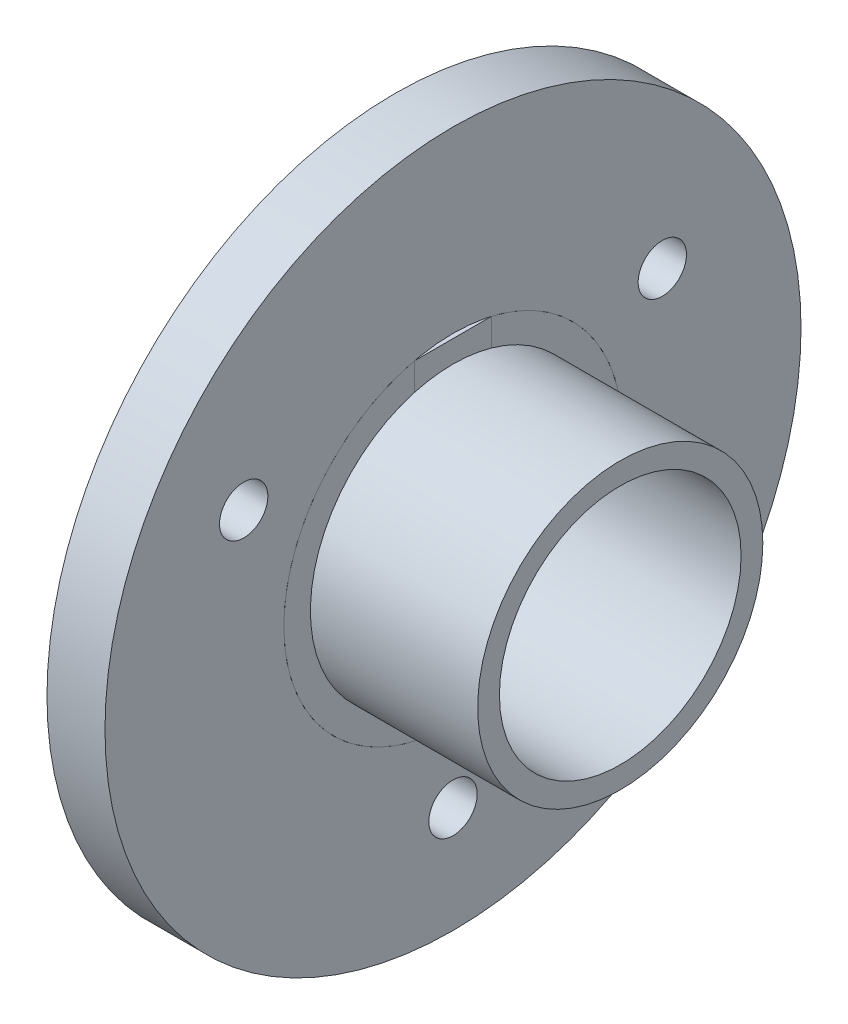
ISO-10303-21;
HEADER;
FILE_DESCRIPTION(('STEP AP214'),'2;1');
FILE_NAME('part.step','',(''),(''),'','','');
FILE_SCHEMA(('AUTOMOTIVE_DESIGN { 1 0 10303 214 1 1 1 1 }'));
ENDSEC;
DATA;
#1=APPLICATION_CONTEXT('core data for automotive mechanical design processes');
#2=APPLICATION_PROTOCOL_DEFINITION('international standard','automotive_design',2000,#1);
#3=PRODUCT_CONTEXT('',#1,'mechanical');
#4=PRODUCT('Part','Part','',(#3));
#5=PRODUCT_RELATED_PRODUCT_CATEGORY('part','',(#4));
#6=PRODUCT_DEFINITION_FORMATION('','',#4);
#7=PRODUCT_DEFINITION_CONTEXT('part definition',#1,'design');
#8=PRODUCT_DEFINITION('design','',#6,#7);
#9=PRODUCT_DEFINITION_SHAPE('','',#8);
#10=(LENGTH_UNIT() NAMED_UNIT(*) SI_UNIT(.MILLI.,.METRE.));
#11=(NAMED_UNIT(*) PLANE_ANGLE_UNIT() SI_UNIT($,.RADIAN.));
#12=(NAMED_UNIT(*) SI_UNIT($,.STERADIAN.) SOLID_ANGLE_UNIT());
#13=UNCERTAINTY_MEASURE_WITH_UNIT(LENGTH_MEASURE(1.E-05),#10,'distance_accuracy_value','');
#14=(GEOMETRIC_REPRESENTATION_CONTEXT(3) GLOBAL_UNCERTAINTY_ASSIGNED_CONTEXT((#13)) GLOBAL_UNIT_ASSIGNED_CONTEXT((#10,
#11,#12)) REPRESENTATION_CONTEXT('',''));
#15=CARTESIAN_POINT('',(0.,0.,0.));
#16=DIRECTION('',(0.,0.,1.));
#17=DIRECTION('',(1.,0.,0.));
#18=AXIS2_PLACEMENT_3D('',#15,#16,#17);
#19=CARTESIAN_POINT('',(-121.650612222677,-138.770848591098,4.));
#20=DIRECTION('',(0.,0.,1.));
#21=DIRECTION('',(0.,-1.,0.));
#22=AXIS2_PLACEMENT_3D('',#19,#20,#21);
#23=PLANE('',#22);
#24=DIRECTION('',(0.,-1.,0.));
#25=VECTOR('',#24,1.);
#26=CARTESIAN_POINT('',(-133.35,-138.770848591098,4.));
#27=LINE('',#26,#25);
#28=CARTESIAN_POINT('',(-133.35,-138.770848591098,4.));
#29=VERTEX_POINT('',#28);
#30=CARTESIAN_POINT('',(-133.35,-147.307573628499,4.));
#31=VERTEX_POINT('',#30);
#32=EDGE_CURVE('E58',#29,#31,#27,.T.);
#33=ORIENTED_EDGE('',*,*,#32,.F.);
#34=DIRECTION('',(-1.,0.,0.));
#35=VECTOR('',#34,1.);
#36=CARTESIAN_POINT('',(-121.650612222677,-138.770848591098,4.));
#37=LINE('',#36,#35);
#38=CARTESIAN_POINT('',(-149.35,-138.770848591098,4.));
#39=VERTEX_POINT('',#38);
#40=EDGE_CURVE('E86',#29,#39,#37,.T.);
#41=ORIENTED_EDGE('',*,*,#40,.T.);
#42=DIRECTION('',(0.,1.,0.));
#43=VECTOR('',#42,1.);
#44=CARTESIAN_POINT('',(-149.35,-138.770848591098,4.));
#45=LINE('',#44,#43);
#46=CARTESIAN_POINT('',(-149.35,-147.307573628499,4.));
#47=VERTEX_POINT('',#46);
#48=EDGE_CURVE('E90',#47,#39,#45,.T.);
#49=ORIENTED_EDGE('',*,*,#48,.F.);
#50=DIRECTION('',(-1.,0.,0.));
#51=VECTOR('',#50,1.);
#52=CARTESIAN_POINT('',(-121.650612222677,-147.307573628499,4.));
#53=LINE('',#52,#51);
#54=EDGE_CURVE('E113',#31,#47,#53,.T.);
#55=ORIENTED_EDGE('',*,*,#54,.F.);
#56=EDGE_LOOP('',(#33,#41,#49,#55));
#57=FACE_BOUND('',#56,.T.);
#58=ADVANCED_FACE('F50',(#57),#23,.T.);
#59=CARTESIAN_POINT('',(-121.650612222677,-147.307573628499,4.));
#60=DIRECTION('',(0.,-1.,0.));
#61=DIRECTION('',(0.,0.,-1.));
#62=AXIS2_PLACEMENT_3D('',#59,#60,#61);
#63=PLANE('',#62);
#64=DIRECTION('',(0.,0.,-1.));
#65=VECTOR('',#64,1.);
#66=CARTESIAN_POINT('',(-133.35,-147.307573628499,4.));
#67=LINE('',#66,#65);
#68=CARTESIAN_POINT('',(-133.35,-147.307573628499,-4.));
#69=VERTEX_POINT('',#68);
#70=EDGE_CURVE('E64',#31,#69,#67,.T.);
#71=ORIENTED_EDGE('',*,*,#70,.F.);
#72=ORIENTED_EDGE('',*,*,#54,.T.);
#73=DIRECTION('',(0.,0.,1.));
#74=VECTOR('',#73,1.);
#75=CARTESIAN_POINT('',(-149.35,-147.307573628499,4.));
#76=LINE('',#75,#74);
#77=CARTESIAN_POINT('',(-149.35,-147.307573628499,-4.));
#78=VERTEX_POINT('',#77);
#79=EDGE_CURVE('E95',#78,#47,#76,.T.);
#80=ORIENTED_EDGE('',*,*,#79,.F.);
#81=DIRECTION('',(-1.,0.,0.));
#82=VECTOR('',#81,1.);
#83=CARTESIAN_POINT('',(-121.650612222677,-147.307573628499,-4.));
#84=LINE('',#83,#82);
#85=EDGE_CURVE('E116',#69,#78,#84,.T.);
#86=ORIENTED_EDGE('',*,*,#85,.F.);
#87=EDGE_LOOP('',(#71,#72,#80,#86));
#88=FACE_BOUND('',#87,.T.);
#89=ADVANCED_FACE('F122',(#88),#63,.T.);
#90=CARTESIAN_POINT('',(-121.650612222677,-138.770848591098,-4.));
#91=DIRECTION('',(0.,0.,-1.));
#92=DIRECTION('',(0.,1.,0.));
#93=AXIS2_PLACEMENT_3D('',#90,#91,#92);
#94=PLANE('',#93);
#95=DIRECTION('',(0.,1.,0.));
#96=VECTOR('',#95,1.);
#97=CARTESIAN_POINT('',(-133.35,-138.770848591098,-4.));
#98=LINE('',#97,#96);
#99=CARTESIAN_POINT('',(-133.35,-138.770848591098,-4.));
#100=VERTEX_POINT('',#99);
#101=EDGE_CURVE('E115',#69,#100,#98,.T.);
#102=ORIENTED_EDGE('',*,*,#101,.F.);
#103=ORIENTED_EDGE('',*,*,#85,.T.);
#104=DIRECTION('',(0.,-1.,0.));
#105=VECTOR('',#104,1.);
#106=CARTESIAN_POINT('',(-149.35,-138.770848591098,-4.));
#107=LINE('',#106,#105);
#108=CARTESIAN_POINT('',(-149.35,-138.770848591098,-4.));
#109=VERTEX_POINT('',#108);
#110=EDGE_CURVE('E103',#109,#78,#107,.T.);
#111=ORIENTED_EDGE('',*,*,#110,.F.);
#112=DIRECTION('',(-1.,0.,0.));
#113=VECTOR('',#112,1.);
#114=CARTESIAN_POINT('',(-121.650612222677,-138.770848591098,-4.));
#115=LINE('',#114,#113);
#116=EDGE_CURVE('E94',#100,#109,#115,.T.);
#117=ORIENTED_EDGE('',*,*,#116,.F.);
#118=EDGE_LOOP('',(#102,#103,#111,#117));
#119=FACE_BOUND('',#118,.T.);
#120=ADVANCED_FACE('F120',(#119),#94,.T.);
#121=CARTESIAN_POINT('',(-121.650612222677,-138.770848591098,4.));
#122=DIRECTION('',(0.,1.,0.));
#123=DIRECTION('',(0.,0.,1.));
#124=AXIS2_PLACEMENT_3D('',#121,#122,#123);
#125=PLANE('',#124);
#126=DIRECTION('',(0.,0.,1.));
#127=VECTOR('',#126,1.);
#128=CARTESIAN_POINT('',(-133.35,-138.770848591098,4.));
#129=LINE('',#128,#127);
#130=EDGE_CURVE('E12',#100,#29,#129,.T.);
#131=ORIENTED_EDGE('',*,*,#130,.F.);
#132=ORIENTED_EDGE('',*,*,#116,.T.);
#133=DIRECTION('',(0.,0.,-1.));
#134=VECTOR('',#133,1.);
#135=CARTESIAN_POINT('',(-149.35,-138.770848591098,4.));
#136=LINE('',#135,#134);
#137=EDGE_CURVE('E97',#39,#109,#136,.T.);
#138=ORIENTED_EDGE('',*,*,#137,.F.);
#139=ORIENTED_EDGE('',*,*,#40,.F.);
#140=EDGE_LOOP('',(#131,#132,#138,#139));
#141=FACE_BOUND('',#140,.T.);
#142=ADVANCED_FACE('F98',(#141),#125,.T.);
#143=CARTESIAN_POINT('',(-149.35,0.,0.));
#144=DIRECTION('',(1.,0.,0.));
#145=DIRECTION('',(0.,0.,-1.));
#146=AXIS2_PLACEMENT_3D('',#143,#144,#145);
#147=PLANE('',#146);
#148=ORIENTED_EDGE('',*,*,#48,.T.);
#149=ORIENTED_EDGE('',*,*,#137,.T.);
#150=ORIENTED_EDGE('',*,*,#110,.T.);
#151=ORIENTED_EDGE('',*,*,#79,.T.);
#152=EDGE_LOOP('',(#148,#149,#150,#151));
#153=FACE_BOUND('',#152,.T.);
#154=ADVANCED_FACE('F105',(#153),#147,.F.);
#155=CARTESIAN_POINT('',(-133.35,-155.807573628499,0.));
#156=DIRECTION('',(-1.,0.,0.));
#157=DIRECTION('',(0.,0.,1.));
#158=AXIS2_PLACEMENT_3D('',#155,#156,#157);
#159=PLANE('',#158);
#160=ORIENTED_EDGE('',*,*,#32,.T.);
#161=ORIENTED_EDGE('',*,*,#70,.T.);
#162=ORIENTED_EDGE('',*,*,#101,.T.);
#163=ORIENTED_EDGE('',*,*,#130,.T.);
#164=EDGE_LOOP('',(#160,#161,#162,#163));
#165=FACE_BOUND('',#164,.T.);
#166=ADVANCED_FACE('F124',(#165),#159,.F.);
#167=CLOSED_SHELL('',(#58,#89,#120,#142,#154,#166));
#168=MANIFOLD_SOLID_BREP('B2',#167);
#169=CARTESIAN_POINT('',(-139.35,-155.807573628499,0.));
#170=DIRECTION('',(-1.,0.,0.));
#171=DIRECTION('',(0.,0.,1.));
#172=AXIS2_PLACEMENT_3D('',#169,#170,#171);
#173=PLANE('',#172);
#174=CARTESIAN_POINT('',(-139.35,-180.807573628499,0.));
#175=DIRECTION('',(-1.,0.,0.));
#176=DIRECTION('',(0.,0.,1.));
#177=AXIS2_PLACEMENT_3D('',#174,#175,#176);
#178=CIRCLE('',#177,2.5);
#179=CARTESIAN_POINT('',(-139.35,-180.807573628499,2.49999999999999));
#180=VERTEX_POINT('',#179);
#181=EDGE_CURVE('E205',#180,#180,#178,.T.);
#182=ORIENTED_EDGE('',*,*,#181,.F.);
#183=EDGE_LOOP('',(#182));
#184=FACE_BOUND('',#183,.T.);
#185=CARTESIAN_POINT('',(-139.35,-155.807573628499,0.));
#186=DIRECTION('',(-1.,0.,0.));
#187=DIRECTION('',(0.,0.,1.));
#188=AXIS2_PLACEMENT_3D('',#185,#186,#187);
#189=CIRCLE('',#188,17.5);
#190=CARTESIAN_POINT('',(-139.35,-155.807573628499,17.5));
#191=VERTEX_POINT('',#190);
#192=EDGE_CURVE('E194',#191,#191,#189,.T.);
#193=ORIENTED_EDGE('',*,*,#192,.F.);
#194=EDGE_LOOP('',(#193));
#195=FACE_BOUND('',#194,.T.);
#196=CARTESIAN_POINT('',(-139.35,-155.807573628499,0.));
#197=DIRECTION('',(-1.,0.,0.));
#198=DIRECTION('',(0.,0.,1.));
#199=AXIS2_PLACEMENT_3D('',#196,#197,#198);
#200=CIRCLE('',#199,36.);
#201=CARTESIAN_POINT('',(-139.35,-155.807573628499,36.));
#202=VERTEX_POINT('',#201);
#203=EDGE_CURVE('E49',#202,#202,#200,.T.);
#204=ORIENTED_EDGE('',*,*,#203,.T.);
#205=EDGE_LOOP('',(#204));
#206=FACE_BOUND('',#205,.T.);
#207=CARTESIAN_POINT('',(-139.35,-143.307573628499,-21.6506350946111));
#208=DIRECTION('',(-1.,0.,0.));
#209=DIRECTION('',(0.,0.,1.));
#210=AXIS2_PLACEMENT_3D('',#207,#208,#209);
#211=CIRCLE('',#210,2.5);
#212=CARTESIAN_POINT('',(-139.35,-143.307573628499,-19.1506350946111));
#213=VERTEX_POINT('',#212);
#214=EDGE_CURVE('E199',#213,#213,#211,.T.);
#215=ORIENTED_EDGE('',*,*,#214,.F.);
#216=EDGE_LOOP('',(#215));
#217=FACE_BOUND('',#216,.T.);
#218=CARTESIAN_POINT('',(-139.35,-143.307573628498,21.6506350946109));
#219=DIRECTION('',(-1.,0.,0.));
#220=DIRECTION('',(0.,0.,1.));
#221=AXIS2_PLACEMENT_3D('',#218,#219,#220);
#222=CIRCLE('',#221,2.5);
#223=CARTESIAN_POINT('',(-139.35,-143.307573628498,24.1506350946109));
#224=VERTEX_POINT('',#223);
#225=EDGE_CURVE('E211',#224,#224,#222,.T.);
#226=ORIENTED_EDGE('',*,*,#225,.F.);
#227=EDGE_LOOP('',(#226));
#228=FACE_BOUND('',#227,.T.);
#229=ADVANCED_FACE('F183',(#184,#195,#206,#217,#228),#173,.T.);
#230=CARTESIAN_POINT('',(-133.35,-155.807573628499,0.));
#231=DIRECTION('',(-1.,0.,0.));
#232=DIRECTION('',(0.,0.,1.));
#233=AXIS2_PLACEMENT_3D('',#230,#231,#232);
#234=PLANE('',#233);
#235=CARTESIAN_POINT('',(-133.35,-155.807573628499,0.));
#236=DIRECTION('',(-1.,0.,0.));
#237=DIRECTION('',(0.,0.,1.));
#238=AXIS2_PLACEMENT_3D('',#235,#236,#237);
#239=CIRCLE('',#238,36.);
#240=CARTESIAN_POINT('',(-133.35,-155.807573628499,36.));
#241=VERTEX_POINT('',#240);
#242=EDGE_CURVE('E187',#241,#241,#239,.T.);
#243=ORIENTED_EDGE('',*,*,#242,.F.);
#244=EDGE_LOOP('',(#243));
#245=FACE_BOUND('',#244,.T.);
#246=CARTESIAN_POINT('',(-133.35,-155.807573628499,0.));
#247=DIRECTION('',(-1.,0.,0.));
#248=DIRECTION('',(0.,0.,1.));
#249=AXIS2_PLACEMENT_3D('',#246,#247,#248);
#250=CIRCLE('',#249,17.5);
#251=CARTESIAN_POINT('',(-133.35,-155.807573628499,17.5));
#252=VERTEX_POINT('',#251);
#253=EDGE_CURVE('E196',#252,#252,#250,.T.);
#254=ORIENTED_EDGE('',*,*,#253,.T.);
#255=EDGE_LOOP('',(#254));
#256=FACE_BOUND('',#255,.T.);
#257=CARTESIAN_POINT('',(-133.35,-143.307573628499,-21.6506350946111));
#258=DIRECTION('',(-1.,0.,0.));
#259=DIRECTION('',(0.,0.,1.));
#260=AXIS2_PLACEMENT_3D('',#257,#258,#259);
#261=CIRCLE('',#260,2.5);
#262=CARTESIAN_POINT('',(-133.35,-143.307573628499,-19.1506350946111));
#263=VERTEX_POINT('',#262);
#264=EDGE_CURVE('E202',#263,#263,#261,.T.);
#265=ORIENTED_EDGE('',*,*,#264,.T.);
#266=EDGE_LOOP('',(#265));
#267=FACE_BOUND('',#266,.T.);
#268=CARTESIAN_POINT('',(-133.35,-180.807573628499,0.));
#269=DIRECTION('',(-1.,0.,0.));
#270=DIRECTION('',(0.,0.,1.));
#271=AXIS2_PLACEMENT_3D('',#268,#269,#270);
#272=CIRCLE('',#271,2.5);
#273=CARTESIAN_POINT('',(-133.35,-180.807573628499,2.49999999999999));
#274=VERTEX_POINT('',#273);
#275=EDGE_CURVE('E208',#274,#274,#272,.T.);
#276=ORIENTED_EDGE('',*,*,#275,.T.);
#277=EDGE_LOOP('',(#276));
#278=FACE_BOUND('',#277,.T.);
#279=CARTESIAN_POINT('',(-133.35,-143.307573628498,21.6506350946109));
#280=DIRECTION('',(-1.,0.,0.));
#281=DIRECTION('',(0.,0.,1.));
#282=AXIS2_PLACEMENT_3D('',#279,#280,#281);
#283=CIRCLE('',#282,2.5);
#284=CARTESIAN_POINT('',(-133.35,-143.307573628498,24.1506350946109));
#285=VERTEX_POINT('',#284);
#286=EDGE_CURVE('E214',#285,#285,#283,.T.);
#287=ORIENTED_EDGE('',*,*,#286,.T.);
#288=EDGE_LOOP('',(#287));
#289=FACE_BOUND('',#288,.T.);
#290=ADVANCED_FACE('F224',(#245,#256,#267,#278,#289),#234,.F.);
#291=CARTESIAN_POINT('',(-139.35,-155.807573628499,0.));
#292=DIRECTION('',(1.,0.,0.));
#293=DIRECTION('',(0.,0.,-1.));
#294=AXIS2_PLACEMENT_3D('',#291,#292,#293);
#295=CYLINDRICAL_SURFACE('',#294,36.);
#296=ORIENTED_EDGE('',*,*,#203,.F.);
#297=EDGE_LOOP('',(#296));
#298=FACE_BOUND('',#297,.T.);
#299=ORIENTED_EDGE('',*,*,#242,.T.);
#300=EDGE_LOOP('',(#299));
#301=FACE_BOUND('',#300,.T.);
#302=ADVANCED_FACE('F185',(#298,#301),#295,.T.);
#303=CARTESIAN_POINT('',(-139.35,-155.807573628499,0.));
#304=DIRECTION('',(1.,0.,0.));
#305=DIRECTION('',(0.,0.,-1.));
#306=AXIS2_PLACEMENT_3D('',#303,#304,#305);
#307=CYLINDRICAL_SURFACE('',#306,17.5);
#308=ORIENTED_EDGE('',*,*,#192,.T.);
#309=EDGE_LOOP('',(#308));
#310=FACE_BOUND('',#309,.T.);
#311=ORIENTED_EDGE('',*,*,#253,.F.);
#312=EDGE_LOOP('',(#311));
#313=FACE_BOUND('',#312,.T.);
#314=ADVANCED_FACE('F234',(#310,#313),#307,.F.);
#315=CARTESIAN_POINT('',(-139.35,-143.307573628499,-21.6506350946111));
#316=DIRECTION('',(1.,0.,0.));
#317=DIRECTION('',(0.,0.,-1.));
#318=AXIS2_PLACEMENT_3D('',#315,#316,#317);
#319=CYLINDRICAL_SURFACE('',#318,2.5);
#320=ORIENTED_EDGE('',*,*,#214,.T.);
#321=EDGE_LOOP('',(#320));
#322=FACE_BOUND('',#321,.T.);
#323=ORIENTED_EDGE('',*,*,#264,.F.);
#324=EDGE_LOOP('',(#323));
#325=FACE_BOUND('',#324,.T.);
#326=ADVANCED_FACE('F237',(#322,#325),#319,.F.);
#327=CARTESIAN_POINT('',(-139.35,-180.807573628499,0.));
#328=DIRECTION('',(1.,0.,0.));
#329=DIRECTION('',(0.,0.,-1.));
#330=AXIS2_PLACEMENT_3D('',#327,#328,#329);
#331=CYLINDRICAL_SURFACE('',#330,2.5);
#332=ORIENTED_EDGE('',*,*,#181,.T.);
#333=EDGE_LOOP('',(#332));
#334=FACE_BOUND('',#333,.T.);
#335=ORIENTED_EDGE('',*,*,#275,.F.);
#336=EDGE_LOOP('',(#335));
#337=FACE_BOUND('',#336,.T.);
#338=ADVANCED_FACE('F241',(#334,#337),#331,.F.);
#339=CARTESIAN_POINT('',(-139.35,-143.307573628498,21.6506350946109));
#340=DIRECTION('',(1.,0.,0.));
#341=DIRECTION('',(0.,0.,-1.));
#342=AXIS2_PLACEMENT_3D('',#339,#340,#341);
#343=CYLINDRICAL_SURFACE('',#342,2.5);
#344=ORIENTED_EDGE('',*,*,#225,.T.);
#345=EDGE_LOOP('',(#344));
#346=FACE_BOUND('',#345,.T.);
#347=ORIENTED_EDGE('',*,*,#286,.F.);
#348=EDGE_LOOP('',(#347));
#349=FACE_BOUND('',#348,.T.);
#350=ADVANCED_FACE('F220',(#346,#349),#343,.F.);
#351=CLOSED_SHELL('',(#229,#290,#302,#314,#326,#338,#350));
#352=MANIFOLD_SOLID_BREP('B6',#351);
#353=CARTESIAN_POINT('',(-122.602643770449,-155.807573628499,0.));
#354=DIRECTION('',(1.,0.,0.));
#355=DIRECTION('',(0.,0.,-1.));
#356=AXIS2_PLACEMENT_3D('',#353,#354,#355);
#357=CYLINDRICAL_SURFACE('',#356,14.7500000000002);
#358=CARTESIAN_POINT('',(-133.35,-155.807573628499,0.));
#359=DIRECTION('',(1.,0.,0.));
#360=DIRECTION('',(0.,0.,-1.));
#361=AXIS2_PLACEMENT_3D('',#358,#359,#360);
#362=CIRCLE('',#361,14.7500000000002);
#363=CARTESIAN_POINT('',(-133.35,-141.610302763998,-4.));
#364=VERTEX_POINT('',#363);
#365=CARTESIAN_POINT('',(-133.35,-141.610302763998,4.));
#366=VERTEX_POINT('',#365);
#367=EDGE_CURVE('E391',#364,#366,#362,.T.);
#368=ORIENTED_EDGE('',*,*,#367,.T.);
#369=EDGE_CURVE('E413',#366,#364,#362,.T.);
#370=ORIENTED_EDGE('',*,*,#369,.T.);
#371=EDGE_LOOP('',(#368,#370));
#372=FACE_BOUND('',#371,.T.);
#373=CARTESIAN_POINT('',(-116.05,-155.807573628499,0.));
#374=DIRECTION('',(1.,0.,0.));
#375=DIRECTION('',(0.,0.,-1.));
#376=AXIS2_PLACEMENT_3D('',#373,#374,#375);
#377=CIRCLE('',#376,14.7500000000002);
#378=CARTESIAN_POINT('',(-116.05,-155.807573628499,-14.7500000000002));
#379=VERTEX_POINT('',#378);
#380=EDGE_CURVE('E328',#379,#379,#377,.T.);
#381=ORIENTED_EDGE('',*,*,#380,.F.);
#382=EDGE_LOOP('',(#381));
#383=FACE_BOUND('',#382,.T.);
#384=ADVANCED_FACE('F321',(#372,#383),#357,.T.);
#385=CARTESIAN_POINT('',(-116.05,-141.057573628498,0.));
#386=DIRECTION('',(1.,0.,0.));
#387=DIRECTION('',(0.,0.,-1.));
#388=AXIS2_PLACEMENT_3D('',#385,#386,#387);
#389=PLANE('',#388);
#390=ORIENTED_EDGE('',*,*,#380,.T.);
#391=EDGE_LOOP('',(#390));
#392=FACE_BOUND('',#391,.T.);
#393=CARTESIAN_POINT('',(-116.05,-155.807573628499,0.));
#394=DIRECTION('',(1.,0.,0.));
#395=DIRECTION('',(0.,0.,-1.));
#396=AXIS2_PLACEMENT_3D('',#393,#394,#395);
#397=CIRCLE('',#396,12.5);
#398=CARTESIAN_POINT('',(-116.05,-155.807573628499,-12.5));
#399=VERTEX_POINT('',#398);
#400=EDGE_CURVE('E389',#399,#399,#397,.T.);
#401=ORIENTED_EDGE('',*,*,#400,.F.);
#402=EDGE_LOOP('',(#401));
#403=FACE_BOUND('',#402,.T.);
#404=ADVANCED_FACE('F399',(#392,#403),#389,.T.);
#405=CARTESIAN_POINT('',(-122.602643770449,-155.807573628499,0.));
#406=DIRECTION('',(1.,0.,0.));
#407=DIRECTION('',(0.,0.,-1.));
#408=AXIS2_PLACEMENT_3D('',#405,#406,#407);
#409=CYLINDRICAL_SURFACE('',#408,12.5);
#410=DIRECTION('',(1.,0.,0.));
#411=VECTOR('',#410,1.);
#412=CARTESIAN_POINT('',(-122.602643770449,-143.964854346172,-4.));
#413=LINE('',#412,#411);
#414=CARTESIAN_POINT('',(-149.35,-143.964854346172,-4.));
#415=VERTEX_POINT('',#414);
#416=CARTESIAN_POINT('',(-133.35,-143.964854346172,-4.));
#417=VERTEX_POINT('',#416);
#418=EDGE_CURVE('E421',#415,#417,#413,.T.);
#419=ORIENTED_EDGE('',*,*,#418,.F.);
#420=CARTESIAN_POINT('',(-149.35,-155.807573628499,0.));
#421=DIRECTION('',(1.,0.,0.));
#422=DIRECTION('',(0.,0.,-1.));
#423=AXIS2_PLACEMENT_3D('',#420,#421,#422);
#424=CIRCLE('',#423,12.5);
#425=CARTESIAN_POINT('',(-149.35,-143.964854346172,4.));
#426=VERTEX_POINT('',#425);
#427=EDGE_CURVE('E387',#426,#415,#424,.T.);
#428=ORIENTED_EDGE('',*,*,#427,.F.);
#429=DIRECTION('',(1.,0.,0.));
#430=VECTOR('',#429,1.);
#431=CARTESIAN_POINT('',(-122.602643770449,-143.964854346172,4.));
#432=LINE('',#431,#430);
#433=CARTESIAN_POINT('',(-133.35,-143.964854346172,4.));
#434=VERTEX_POINT('',#433);
#435=EDGE_CURVE('E368',#434,#426,#432,.F.);
#436=ORIENTED_EDGE('',*,*,#435,.F.);
#437=CARTESIAN_POINT('',(-133.35,-155.807573628499,0.));
#438=DIRECTION('',(1.,0.,0.));
#439=DIRECTION('',(0.,0.,-1.));
#440=AXIS2_PLACEMENT_3D('',#437,#438,#439);
#441=CIRCLE('',#440,12.5);
#442=EDGE_CURVE('E418',#417,#434,#441,.T.);
#443=ORIENTED_EDGE('',*,*,#442,.F.);
#444=EDGE_LOOP('',(#419,#428,#436,#443));
#445=FACE_BOUND('',#444,.T.);
#446=ORIENTED_EDGE('',*,*,#400,.T.);
#447=EDGE_LOOP('',(#446));
#448=FACE_BOUND('',#447,.T.);
#449=ADVANCED_FACE('F409',(#445,#448),#409,.F.);
#450=CARTESIAN_POINT('',(-149.35,-143.307573628499,0.));
#451=DIRECTION('',(-1.,0.,0.));
#452=DIRECTION('',(0.,0.,1.));
#453=AXIS2_PLACEMENT_3D('',#450,#451,#452);
#454=PLANE('',#453);
#455=DIRECTION('',(0.,-1.,0.));
#456=VECTOR('',#455,1.);
#457=CARTESIAN_POINT('',(-149.35,-138.770848591098,-4.));
#458=LINE('',#457,#456);
#459=CARTESIAN_POINT('',(-149.35,-138.770848591098,-4.));
#460=VERTEX_POINT('',#459);
#461=EDGE_CURVE('E342',#460,#415,#458,.T.);
#462=ORIENTED_EDGE('',*,*,#461,.F.);
#463=CARTESIAN_POINT('',(-149.35,-155.807573628499,0.));
#464=DIRECTION('',(1.,0.,0.));
#465=DIRECTION('',(0.,0.,-1.));
#466=AXIS2_PLACEMENT_3D('',#463,#464,#465);
#467=CIRCLE('',#466,17.5);
#468=CARTESIAN_POINT('',(-149.35,-138.770848591098,4.));
#469=VERTEX_POINT('',#468);
#470=EDGE_CURVE('E380',#469,#460,#467,.T.);
#471=ORIENTED_EDGE('',*,*,#470,.F.);
#472=DIRECTION('',(0.,1.,0.));
#473=VECTOR('',#472,1.);
#474=CARTESIAN_POINT('',(-149.35,-147.307573628499,4.));
#475=LINE('',#474,#473);
#476=EDGE_CURVE('E364',#426,#469,#475,.T.);
#477=ORIENTED_EDGE('',*,*,#476,.F.);
#478=ORIENTED_EDGE('',*,*,#427,.T.);
#479=EDGE_LOOP('',(#462,#471,#477,#478));
#480=FACE_BOUND('',#479,.T.);
#481=ADVANCED_FACE('F386',(#480),#454,.T.);
#482=CARTESIAN_POINT('',(-122.602643770449,-155.807573628499,0.));
#483=DIRECTION('',(1.,0.,0.));
#484=DIRECTION('',(0.,0.,-1.));
#485=AXIS2_PLACEMENT_3D('',#482,#483,#484);
#486=CYLINDRICAL_SURFACE('',#485,17.5);
#487=DIRECTION('',(-1.,0.,0.));
#488=VECTOR('',#487,1.);
#489=CARTESIAN_POINT('',(-121.308405421208,-138.770848591098,-4.));
#490=LINE('',#489,#488);
#491=CARTESIAN_POINT('',(-133.35,-138.770848591098,-4.));
#492=VERTEX_POINT('',#491);
#493=EDGE_CURVE('E383',#492,#460,#490,.T.);
#494=ORIENTED_EDGE('',*,*,#493,.F.);
#495=CARTESIAN_POINT('',(-133.35,-155.807573628499,0.));
#496=DIRECTION('',(1.,0.,0.));
#497=DIRECTION('',(0.,0.,-1.));
#498=AXIS2_PLACEMENT_3D('',#495,#496,#497);
#499=CIRCLE('',#498,17.5);
#500=CARTESIAN_POINT('',(-133.35,-138.770848591098,4.));
#501=VERTEX_POINT('',#500);
#502=EDGE_CURVE('E382',#501,#492,#499,.T.);
#503=ORIENTED_EDGE('',*,*,#502,.F.);
#504=DIRECTION('',(-1.,0.,0.));
#505=VECTOR('',#504,1.);
#506=CARTESIAN_POINT('',(-121.308405421208,-138.770848591098,4.));
#507=LINE('',#506,#505);
#508=EDGE_CURVE('E334',#501,#469,#507,.T.);
#509=ORIENTED_EDGE('',*,*,#508,.T.);
#510=ORIENTED_EDGE('',*,*,#470,.T.);
#511=EDGE_LOOP('',(#494,#503,#509,#510));
#512=FACE_BOUND('',#511,.T.);
#513=ADVANCED_FACE('F379',(#512),#486,.T.);
#514=CARTESIAN_POINT('',(-133.35,-138.307573628499,0.));
#515=DIRECTION('',(1.,0.,0.));
#516=DIRECTION('',(0.,0.,-1.));
#517=AXIS2_PLACEMENT_3D('',#514,#515,#516);
#518=PLANE('',#517);
#519=DIRECTION('',(0.,-1.,0.));
#520=VECTOR('',#519,1.);
#521=CARTESIAN_POINT('',(-133.35,-138.770848591098,-4.));
#522=LINE('',#521,#520);
#523=EDGE_CURVE('E426',#492,#364,#522,.T.);
#524=ORIENTED_EDGE('',*,*,#523,.T.);
#525=ORIENTED_EDGE('',*,*,#369,.F.);
#526=DIRECTION('',(0.,-1.,0.));
#527=VECTOR('',#526,1.);
#528=CARTESIAN_POINT('',(-133.35,-138.307573628499,4.));
#529=LINE('',#528,#527);
#530=EDGE_CURVE('E181',#501,#366,#529,.T.);
#531=ORIENTED_EDGE('',*,*,#530,.F.);
#532=ORIENTED_EDGE('',*,*,#502,.T.);
#533=EDGE_LOOP('',(#524,#525,#531,#532));
#534=FACE_BOUND('',#533,.T.);
#535=ADVANCED_FACE('F442',(#534),#518,.T.);
#536=CARTESIAN_POINT('',(-133.35,-138.307573628499,0.));
#537=DIRECTION('',(1.,0.,0.));
#538=DIRECTION('',(0.,0.,-1.));
#539=AXIS2_PLACEMENT_3D('',#536,#537,#538);
#540=PLANE('',#539);
#541=ORIENTED_EDGE('',*,*,#367,.F.);
#542=EDGE_CURVE('E373',#364,#417,#522,.T.);
#543=ORIENTED_EDGE('',*,*,#542,.T.);
#544=ORIENTED_EDGE('',*,*,#442,.T.);
#545=DIRECTION('',(0.,1.,0.));
#546=VECTOR('',#545,1.);
#547=CARTESIAN_POINT('',(-133.35,-147.307573628499,4.));
#548=LINE('',#547,#546);
#549=EDGE_CURVE('E384',#434,#366,#548,.T.);
#550=ORIENTED_EDGE('',*,*,#549,.T.);
#551=EDGE_LOOP('',(#541,#543,#544,#550));
#552=FACE_BOUND('',#551,.T.);
#553=ADVANCED_FACE('F431',(#552),#540,.F.);
#554=CARTESIAN_POINT('',(-121.308405421208,-138.770848591098,-4.));
#555=DIRECTION('',(0.,0.,-1.));
#556=DIRECTION('',(0.,1.,0.));
#557=AXIS2_PLACEMENT_3D('',#554,#555,#556);
#558=PLANE('',#557);
#559=ORIENTED_EDGE('',*,*,#418,.T.);
#560=ORIENTED_EDGE('',*,*,#542,.F.);
#561=ORIENTED_EDGE('',*,*,#523,.F.);
#562=ORIENTED_EDGE('',*,*,#493,.T.);
#563=ORIENTED_EDGE('',*,*,#461,.T.);
#564=EDGE_LOOP('',(#559,#560,#561,#562,#563));
#565=FACE_BOUND('',#564,.T.);
#566=ADVANCED_FACE('F434',(#565),#558,.F.);
#567=CARTESIAN_POINT('',(-121.308405421208,-147.307573628499,4.));
#568=DIRECTION('',(0.,0.,1.));
#569=DIRECTION('',(1.,0.,0.));
#570=AXIS2_PLACEMENT_3D('',#567,#568,#569);
#571=PLANE('',#570);
#572=ORIENTED_EDGE('',*,*,#435,.T.);
#573=ORIENTED_EDGE('',*,*,#476,.T.);
#574=ORIENTED_EDGE('',*,*,#508,.F.);
#575=ORIENTED_EDGE('',*,*,#530,.T.);
#576=ORIENTED_EDGE('',*,*,#549,.F.);
#577=EDGE_LOOP('',(#572,#573,#574,#575,#576));
#578=FACE_BOUND('',#577,.T.);
#579=ADVANCED_FACE('F365',(#578),#571,.F.);
#580=CLOSED_SHELL('',(#384,#404,#449,#481,#513,#535,#553,#566,#579));
#581=MANIFOLD_SOLID_BREP('B44',#580);
#582=ADVANCED_BREP_SHAPE_REPRESENTATION('',(#18,#168,#352,#581),#14);
#583=SHAPE_DEFINITION_REPRESENTATION(#9,#582);
ENDSEC;
END-ISO-10303-21;
